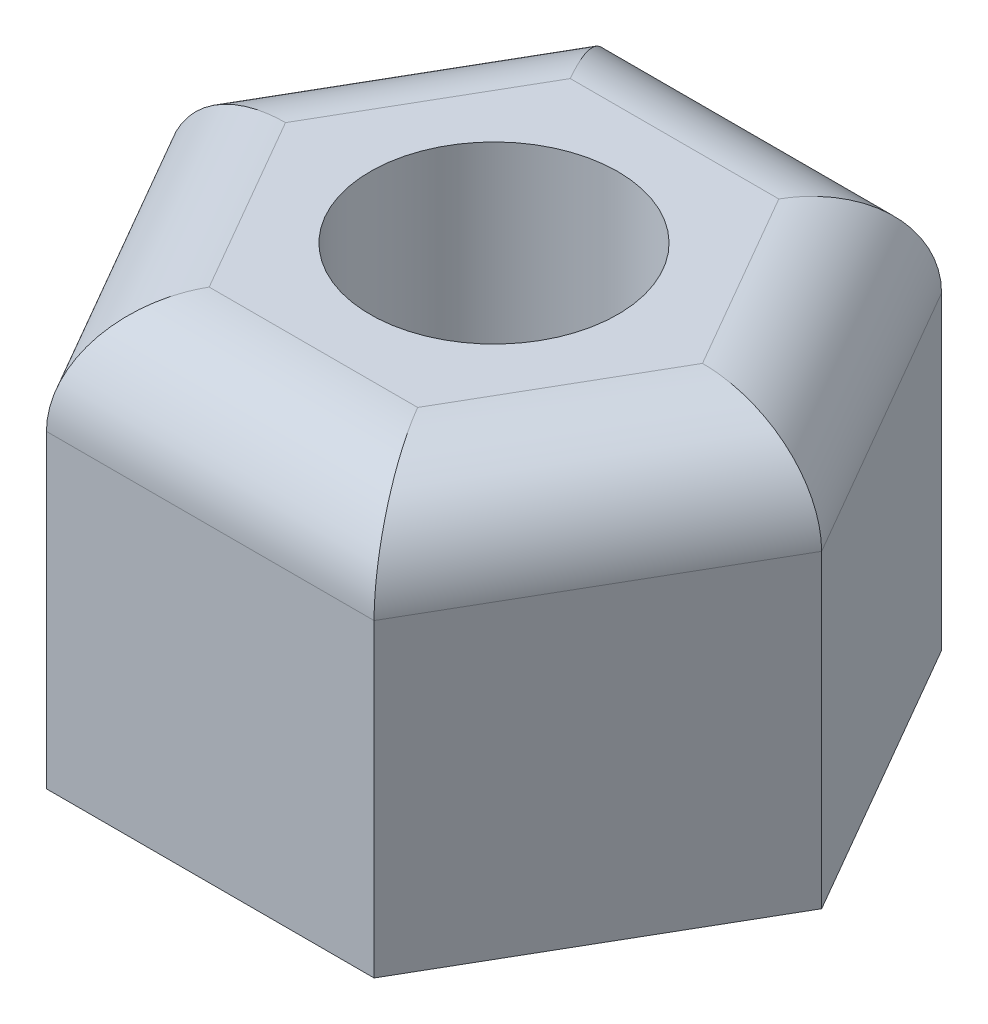
ISO-10303-21;
HEADER;
FILE_DESCRIPTION(('STEP AP214'),'2;1');
FILE_NAME('part.step','',(''),(''),'','','');
FILE_SCHEMA(('AUTOMOTIVE_DESIGN { 1 0 10303 214 1 1 1 1 }'));
ENDSEC;
DATA;
#1=APPLICATION_CONTEXT('core data for automotive mechanical design processes');
#2=APPLICATION_PROTOCOL_DEFINITION('international standard','automotive_design',2000,#1);
#3=PRODUCT_CONTEXT('',#1,'mechanical');
#4=PRODUCT('Part','Part','',(#3));
#5=PRODUCT_RELATED_PRODUCT_CATEGORY('part','',(#4));
#6=PRODUCT_DEFINITION_FORMATION('','',#4);
#7=PRODUCT_DEFINITION_CONTEXT('part definition',#1,'design');
#8=PRODUCT_DEFINITION('design','',#6,#7);
#9=PRODUCT_DEFINITION_SHAPE('','',#8);
#10=(LENGTH_UNIT() NAMED_UNIT(*) SI_UNIT(.MILLI.,.METRE.));
#11=(NAMED_UNIT(*) PLANE_ANGLE_UNIT() SI_UNIT($,.RADIAN.));
#12=(NAMED_UNIT(*) SI_UNIT($,.STERADIAN.) SOLID_ANGLE_UNIT());
#13=UNCERTAINTY_MEASURE_WITH_UNIT(LENGTH_MEASURE(1.E-05),#10,'distance_accuracy_value','');
#14=(GEOMETRIC_REPRESENTATION_CONTEXT(3) GLOBAL_UNCERTAINTY_ASSIGNED_CONTEXT((#13)) GLOBAL_UNIT_ASSIGNED_CONTEXT((#10,
#11,#12)) REPRESENTATION_CONTEXT('',''));
#15=CARTESIAN_POINT('',(0.,0.,0.));
#16=DIRECTION('',(0.,0.,1.));
#17=DIRECTION('',(1.,0.,0.));
#18=AXIS2_PLACEMENT_3D('',#15,#16,#17);
#19=CARTESIAN_POINT('',(1.5877132402715,4.,2.74999999999998));
#20=DIRECTION('',(-0.866025403784442,0.,-0.499999999999995));
#21=DIRECTION('',(-0.499999999999995,0.,0.866025403784442));
#22=AXIS2_PLACEMENT_3D('',#19,#20,#21);
#23=PLANE('',#22);
#24=DIRECTION('',(0.,-1.,0.));
#25=VECTOR('',#24,1.);
#26=CARTESIAN_POINT('',(3.17542648054294,4.,0.));
#27=LINE('',#26,#25);
#28=CARTESIAN_POINT('',(3.17542648054294,3.,0.));
#29=VERTEX_POINT('',#28);
#30=CARTESIAN_POINT('',(3.17542648054294,0.,0.));
#31=VERTEX_POINT('',#30);
#32=EDGE_CURVE('E103',#29,#31,#27,.T.);
#33=ORIENTED_EDGE('',*,*,#32,.F.);
#34=DIRECTION('',(0.499999999999995,0.,-0.866025403784442));
#35=VECTOR('',#34,1.);
#36=CARTESIAN_POINT('',(1.5877132402715,3.,2.74999999999998));
#37=LINE('',#36,#35);
#38=CARTESIAN_POINT('',(1.5877132402715,3.,2.74999999999998));
#39=VERTEX_POINT('',#38);
#40=EDGE_CURVE('E11',#29,#39,#37,.F.);
#41=ORIENTED_EDGE('',*,*,#40,.T.);
#42=DIRECTION('',(0.,-1.,0.));
#43=VECTOR('',#42,1.);
#44=CARTESIAN_POINT('',(1.5877132402715,4.,2.74999999999998));
#45=LINE('',#44,#43);
#46=CARTESIAN_POINT('',(1.5877132402715,0.,2.74999999999998));
#47=VERTEX_POINT('',#46);
#48=EDGE_CURVE('E124',#39,#47,#45,.T.);
#49=ORIENTED_EDGE('',*,*,#48,.T.);
#50=DIRECTION('',(0.499999999999995,0.,-0.866025403784442));
#51=VECTOR('',#50,1.);
#52=CARTESIAN_POINT('',(1.5877132402715,0.,2.74999999999998));
#53=LINE('',#52,#51);
#54=EDGE_CURVE('E118',#47,#31,#53,.T.);
#55=ORIENTED_EDGE('',*,*,#54,.T.);
#56=EDGE_LOOP('',(#33,#41,#49,#55));
#57=FACE_BOUND('',#56,.T.);
#58=ADVANCED_FACE('F33',(#57),#23,.F.);
#59=CARTESIAN_POINT('',(3.17542648054294,4.,0.));
#60=DIRECTION('',(-0.866025403784438,0.,0.500000000000001));
#61=DIRECTION('',(0.500000000000001,0.,0.866025403784438));
#62=AXIS2_PLACEMENT_3D('',#59,#60,#61);
#63=PLANE('',#62);
#64=DIRECTION('',(0.,-1.,0.));
#65=VECTOR('',#64,1.);
#66=CARTESIAN_POINT('',(1.58771324027147,4.,-2.75000000000001));
#67=LINE('',#66,#65);
#68=CARTESIAN_POINT('',(1.58771324027147,3.,-2.75000000000001));
#69=VERTEX_POINT('',#68);
#70=CARTESIAN_POINT('',(1.58771324027147,0.,-2.75000000000001));
#71=VERTEX_POINT('',#70);
#72=EDGE_CURVE('E112',#69,#71,#67,.T.);
#73=ORIENTED_EDGE('',*,*,#72,.F.);
#74=DIRECTION('',(-0.500000000000001,0.,-0.866025403784438));
#75=VECTOR('',#74,1.);
#76=CARTESIAN_POINT('',(3.17542648054294,3.,0.));
#77=LINE('',#76,#75);
#78=EDGE_CURVE('E42',#69,#29,#77,.F.);
#79=ORIENTED_EDGE('',*,*,#78,.T.);
#80=ORIENTED_EDGE('',*,*,#32,.T.);
#81=DIRECTION('',(-0.500000000000001,0.,-0.866025403784438));
#82=VECTOR('',#81,1.);
#83=CARTESIAN_POINT('',(3.17542648054294,0.,0.));
#84=LINE('',#83,#82);
#85=EDGE_CURVE('E106',#31,#71,#84,.T.);
#86=ORIENTED_EDGE('',*,*,#85,.T.);
#87=EDGE_LOOP('',(#73,#79,#80,#86));
#88=FACE_BOUND('',#87,.T.);
#89=ADVANCED_FACE('F105',(#88),#63,.F.);
#90=CARTESIAN_POINT('',(1.58771324027147,4.,-2.75000000000001));
#91=DIRECTION('',(0.,0.,1.));
#92=DIRECTION('',(1.,0.,0.));
#93=AXIS2_PLACEMENT_3D('',#90,#91,#92);
#94=PLANE('',#93);
#95=DIRECTION('',(0.,-1.,0.));
#96=VECTOR('',#95,1.);
#97=CARTESIAN_POINT('',(-1.58771324027148,4.,-2.74999999999999));
#98=LINE('',#97,#96);
#99=CARTESIAN_POINT('',(-1.58771324027148,3.,-2.74999999999999));
#100=VERTEX_POINT('',#99);
#101=CARTESIAN_POINT('',(-1.58771324027148,0.,-2.74999999999999));
#102=VERTEX_POINT('',#101);
#103=EDGE_CURVE('E147',#100,#102,#98,.T.);
#104=ORIENTED_EDGE('',*,*,#103,.F.);
#105=DIRECTION('',(-1.,0.,0.));
#106=VECTOR('',#105,1.);
#107=CARTESIAN_POINT('',(1.58771324027147,3.,-2.75000000000001));
#108=LINE('',#107,#106);
#109=EDGE_CURVE('E57',#100,#69,#108,.F.);
#110=ORIENTED_EDGE('',*,*,#109,.T.);
#111=ORIENTED_EDGE('',*,*,#72,.T.);
#112=DIRECTION('',(-1.,0.,0.));
#113=VECTOR('',#112,1.);
#114=CARTESIAN_POINT('',(1.58771324027147,0.,-2.75000000000001));
#115=LINE('',#114,#113);
#116=EDGE_CURVE('E121',#71,#102,#115,.T.);
#117=ORIENTED_EDGE('',*,*,#116,.T.);
#118=EDGE_LOOP('',(#104,#110,#111,#117));
#119=FACE_BOUND('',#118,.T.);
#120=ADVANCED_FACE('F230',(#119),#94,.F.);
#121=CARTESIAN_POINT('',(-1.58771324027148,4.,-2.74999999999999));
#122=DIRECTION('',(0.866025403784441,0.,0.499999999999995));
#123=DIRECTION('',(0.499999999999995,0.,-0.866025403784442));
#124=AXIS2_PLACEMENT_3D('',#121,#122,#123);
#125=PLANE('',#124);
#126=DIRECTION('',(0.,-1.,0.));
#127=VECTOR('',#126,1.);
#128=CARTESIAN_POINT('',(-3.17542648054294,4.,0.));
#129=LINE('',#128,#127);
#130=CARTESIAN_POINT('',(-3.17542648054294,3.,0.));
#131=VERTEX_POINT('',#130);
#132=CARTESIAN_POINT('',(-3.17542648054294,0.,0.));
#133=VERTEX_POINT('',#132);
#134=EDGE_CURVE('E145',#131,#133,#129,.T.);
#135=ORIENTED_EDGE('',*,*,#134,.F.);
#136=DIRECTION('',(-0.499999999999995,0.,0.866025403784442));
#137=VECTOR('',#136,1.);
#138=CARTESIAN_POINT('',(-1.58771324027148,3.,-2.74999999999999));
#139=LINE('',#138,#137);
#140=EDGE_CURVE('E167',#131,#100,#139,.F.);
#141=ORIENTED_EDGE('',*,*,#140,.T.);
#142=ORIENTED_EDGE('',*,*,#103,.T.);
#143=DIRECTION('',(-0.499999999999995,0.,0.866025403784441));
#144=VECTOR('',#143,1.);
#145=CARTESIAN_POINT('',(-1.58771324027148,0.,-2.74999999999999));
#146=LINE('',#145,#144);
#147=EDGE_CURVE('E134',#102,#133,#146,.T.);
#148=ORIENTED_EDGE('',*,*,#147,.T.);
#149=EDGE_LOOP('',(#135,#141,#142,#148));
#150=FACE_BOUND('',#149,.T.);
#151=ADVANCED_FACE('F215',(#150),#125,.F.);
#152=CARTESIAN_POINT('',(-3.17542648054294,4.,0.));
#153=DIRECTION('',(0.866025403784435,0.,-0.500000000000007));
#154=DIRECTION('',(-0.500000000000007,0.,-0.866025403784435));
#155=AXIS2_PLACEMENT_3D('',#152,#153,#154);
#156=PLANE('',#155);
#157=DIRECTION('',(0.,-1.,0.));
#158=VECTOR('',#157,1.);
#159=CARTESIAN_POINT('',(-1.58771324027145,4.,2.75000000000002));
#160=LINE('',#159,#158);
#161=CARTESIAN_POINT('',(-1.58771324027145,3.,2.75000000000002));
#162=VERTEX_POINT('',#161);
#163=CARTESIAN_POINT('',(-1.58771324027145,0.,2.75000000000002));
#164=VERTEX_POINT('',#163);
#165=EDGE_CURVE('E143',#162,#164,#160,.T.);
#166=ORIENTED_EDGE('',*,*,#165,.F.);
#167=DIRECTION('',(0.500000000000007,0.,0.866025403784435));
#168=VECTOR('',#167,1.);
#169=CARTESIAN_POINT('',(-3.17542648054294,3.,0.));
#170=LINE('',#169,#168);
#171=EDGE_CURVE('E165',#162,#131,#170,.F.);
#172=ORIENTED_EDGE('',*,*,#171,.T.);
#173=ORIENTED_EDGE('',*,*,#134,.T.);
#174=DIRECTION('',(0.500000000000007,0.,0.866025403784435));
#175=VECTOR('',#174,1.);
#176=CARTESIAN_POINT('',(-3.17542648054294,0.,0.));
#177=LINE('',#176,#175);
#178=EDGE_CURVE('E137',#133,#164,#177,.T.);
#179=ORIENTED_EDGE('',*,*,#178,.T.);
#180=EDGE_LOOP('',(#166,#172,#173,#179));
#181=FACE_BOUND('',#180,.T.);
#182=ADVANCED_FACE('F212',(#181),#156,.F.);
#183=CARTESIAN_POINT('',(-1.58771324027145,4.,2.75000000000002));
#184=DIRECTION('',(0.,0.,-1.));
#185=DIRECTION('',(-1.,0.,0.));
#186=AXIS2_PLACEMENT_3D('',#183,#184,#185);
#187=PLANE('',#186);
#188=ORIENTED_EDGE('',*,*,#48,.F.);
#189=DIRECTION('',(1.,0.,0.));
#190=VECTOR('',#189,1.);
#191=CARTESIAN_POINT('',(-1.58771324027145,3.,2.75000000000002));
#192=LINE('',#191,#190);
#193=EDGE_CURVE('E162',#39,#162,#192,.F.);
#194=ORIENTED_EDGE('',*,*,#193,.T.);
#195=ORIENTED_EDGE('',*,*,#165,.T.);
#196=DIRECTION('',(1.,0.,0.));
#197=VECTOR('',#196,1.);
#198=CARTESIAN_POINT('',(-1.58771324027145,0.,2.75000000000002));
#199=LINE('',#198,#197);
#200=EDGE_CURVE('E140',#164,#47,#199,.T.);
#201=ORIENTED_EDGE('',*,*,#200,.T.);
#202=EDGE_LOOP('',(#188,#194,#195,#201));
#203=FACE_BOUND('',#202,.T.);
#204=ADVANCED_FACE('F201',(#203),#187,.F.);
#205=CARTESIAN_POINT('',(0.,4.,0.));
#206=DIRECTION('',(0.,1.,0.));
#207=DIRECTION('',(0.,0.,1.));
#208=AXIS2_PLACEMENT_3D('',#205,#206,#207);
#209=PLANE('',#208);
#210=CARTESIAN_POINT('',(0.,4.,0.));
#211=DIRECTION('',(0.,-1.,0.));
#212=DIRECTION('',(0.,0.,-1.));
#213=AXIS2_PLACEMENT_3D('',#210,#211,#212);
#214=CIRCLE('',#213,1.2);
#215=CARTESIAN_POINT('',(0.,4.,-1.2));
#216=VERTEX_POINT('',#215);
#217=EDGE_CURVE('E174',#216,#216,#214,.T.);
#218=ORIENTED_EDGE('',*,*,#217,.T.);
#219=EDGE_LOOP('',(#218));
#220=FACE_BOUND('',#219,.T.);
#221=DIRECTION('',(0.500000000000007,0.,0.866025403784435));
#222=VECTOR('',#221,1.);
#223=CARTESIAN_POINT('',(-0.721687836487011,4.,2.25000000000001));
#224=LINE('',#223,#222);
#225=CARTESIAN_POINT('',(-2.02072594216369,4.,0.));
#226=VERTEX_POINT('',#225);
#227=CARTESIAN_POINT('',(-1.01036297108183,4.,1.75000000000001));
#228=VERTEX_POINT('',#227);
#229=EDGE_CURVE('E157',#226,#228,#224,.T.);
#230=ORIENTED_EDGE('',*,*,#229,.T.);
#231=DIRECTION('',(1.,0.,0.));
#232=VECTOR('',#231,1.);
#233=CARTESIAN_POINT('',(1.58771324027149,4.,1.74999999999998));
#234=LINE('',#233,#232);
#235=CARTESIAN_POINT('',(1.01036297108187,4.,1.74999999999999));
#236=VERTEX_POINT('',#235);
#237=EDGE_CURVE('E159',#228,#236,#234,.T.);
#238=ORIENTED_EDGE('',*,*,#237,.T.);
#239=DIRECTION('',(0.499999999999995,0.,-0.866025403784442));
#240=VECTOR('',#239,1.);
#241=CARTESIAN_POINT('',(2.3094010767585,4.,-0.499999999999995));
#242=LINE('',#241,#240);
#243=CARTESIAN_POINT('',(2.02072594216369,4.,0.));
#244=VERTEX_POINT('',#243);
#245=EDGE_CURVE('E111',#236,#244,#242,.T.);
#246=ORIENTED_EDGE('',*,*,#245,.T.);
#247=DIRECTION('',(-0.500000000000001,0.,-0.866025403784438));
#248=VECTOR('',#247,1.);
#249=CARTESIAN_POINT('',(0.721687836487028,4.,-2.25));
#250=LINE('',#249,#248);
#251=CARTESIAN_POINT('',(1.01036297108184,4.,-1.75));
#252=VERTEX_POINT('',#251);
#253=EDGE_CURVE('E151',#244,#252,#250,.T.);
#254=ORIENTED_EDGE('',*,*,#253,.T.);
#255=DIRECTION('',(-1.,0.,0.));
#256=VECTOR('',#255,1.);
#257=CARTESIAN_POINT('',(-1.58771324027148,4.,-1.74999999999999));
#258=LINE('',#257,#256);
#259=CARTESIAN_POINT('',(-1.01036297108185,4.,-1.75));
#260=VERTEX_POINT('',#259);
#261=EDGE_CURVE('E153',#252,#260,#258,.T.);
#262=ORIENTED_EDGE('',*,*,#261,.T.);
#263=DIRECTION('',(-0.499999999999995,0.,0.866025403784442));
#264=VECTOR('',#263,1.);
#265=CARTESIAN_POINT('',(-2.3094010767585,4.,0.500000000000018));
#266=LINE('',#265,#264);
#267=EDGE_CURVE('E155',#260,#226,#266,.T.);
#268=ORIENTED_EDGE('',*,*,#267,.T.);
#269=EDGE_LOOP('',(#230,#238,#246,#254,#262,#268));
#270=FACE_BOUND('',#269,.T.);
#271=ADVANCED_FACE('F191',(#220,#270),#209,.T.);
#272=CARTESIAN_POINT('',(0.,0.,0.));
#273=DIRECTION('',(0.,1.,0.));
#274=DIRECTION('',(0.,0.,1.));
#275=AXIS2_PLACEMENT_3D('',#272,#273,#274);
#276=PLANE('',#275);
#277=CARTESIAN_POINT('',(0.,0.,0.));
#278=DIRECTION('',(0.,-1.,0.));
#279=DIRECTION('',(0.,0.,-1.));
#280=AXIS2_PLACEMENT_3D('',#277,#278,#279);
#281=CIRCLE('',#280,1.2);
#282=CARTESIAN_POINT('',(0.,0.,-1.2));
#283=VERTEX_POINT('',#282);
#284=EDGE_CURVE('E130',#283,#283,#281,.T.);
#285=ORIENTED_EDGE('',*,*,#284,.F.);
#286=EDGE_LOOP('',(#285));
#287=FACE_BOUND('',#286,.T.);
#288=ORIENTED_EDGE('',*,*,#54,.F.);
#289=ORIENTED_EDGE('',*,*,#200,.F.);
#290=ORIENTED_EDGE('',*,*,#178,.F.);
#291=ORIENTED_EDGE('',*,*,#147,.F.);
#292=ORIENTED_EDGE('',*,*,#116,.F.);
#293=ORIENTED_EDGE('',*,*,#85,.F.);
#294=EDGE_LOOP('',(#288,#289,#290,#291,#292,#293));
#295=FACE_BOUND('',#294,.T.);
#296=ADVANCED_FACE('F116',(#287,#295),#276,.F.);
#297=CARTESIAN_POINT('',(0.,3.,-1.75));
#298=DIRECTION('',(1.,0.,0.));
#299=DIRECTION('',(0.,0.,-1.));
#300=AXIS2_PLACEMENT_3D('',#297,#298,#299);
#301=CYLINDRICAL_SURFACE('',#300,1.);
#302=CARTESIAN_POINT('',(1.01036297108184,3.,-1.75));
#303=DIRECTION('',(0.86602540378444,0.,0.499999999999998));
#304=DIRECTION('',(-0.499999999999998,0.,0.86602540378444));
#305=AXIS2_PLACEMENT_3D('',#302,#303,#304);
#306=ELLIPSE('',#305,1.15470053837925,1.);
#307=EDGE_CURVE('E128',#69,#252,#306,.T.);
#308=ORIENTED_EDGE('',*,*,#307,.F.);
#309=ORIENTED_EDGE('',*,*,#109,.F.);
#310=CARTESIAN_POINT('',(-1.01036297108185,3.,-1.75));
#311=DIRECTION('',(0.866025403784436,0.,-0.500000000000004));
#312=DIRECTION('',(0.500000000000004,0.,0.866025403784436));
#313=AXIS2_PLACEMENT_3D('',#310,#311,#312);
#314=ELLIPSE('',#313,1.15470053837925,1.);
#315=EDGE_CURVE('E37',#260,#100,#314,.F.);
#316=ORIENTED_EDGE('',*,*,#315,.F.);
#317=ORIENTED_EDGE('',*,*,#261,.F.);
#318=EDGE_LOOP('',(#308,#309,#316,#317));
#319=FACE_BOUND('',#318,.T.);
#320=ADVANCED_FACE('F35',(#319),#301,.T.);
#321=CARTESIAN_POINT('',(-1.51554445662277,3.,-0.874999999999991));
#322=DIRECTION('',(0.499999999999995,0.,-0.866025403784442));
#323=DIRECTION('',(-0.866025403784441,0.,-0.499999999999995));
#324=AXIS2_PLACEMENT_3D('',#321,#322,#323);
#325=CYLINDRICAL_SURFACE('',#324,1.);
#326=ORIENTED_EDGE('',*,*,#315,.T.);
#327=ORIENTED_EDGE('',*,*,#140,.F.);
#328=CARTESIAN_POINT('',(-2.02072594216369,3.,0.));
#329=DIRECTION('',(0.,0.,-1.));
#330=DIRECTION('',(1.,0.,0.));
#331=AXIS2_PLACEMENT_3D('',#328,#329,#330);
#332=ELLIPSE('',#331,1.15470053837925,1.);
#333=EDGE_CURVE('E179',#226,#131,#332,.F.);
#334=ORIENTED_EDGE('',*,*,#333,.F.);
#335=ORIENTED_EDGE('',*,*,#267,.F.);
#336=EDGE_LOOP('',(#326,#327,#334,#335));
#337=FACE_BOUND('',#336,.T.);
#338=ADVANCED_FACE('F218',(#337),#325,.T.);
#339=CARTESIAN_POINT('',(1.51554445662277,3.,-0.875000000000002));
#340=DIRECTION('',(0.500000000000001,0.,0.866025403784438));
#341=DIRECTION('',(0.866025403784438,0.,-0.500000000000001));
#342=AXIS2_PLACEMENT_3D('',#339,#340,#341);
#343=CYLINDRICAL_SURFACE('',#342,1.);
#344=ORIENTED_EDGE('',*,*,#307,.T.);
#345=ORIENTED_EDGE('',*,*,#253,.F.);
#346=CARTESIAN_POINT('',(2.02072594216369,3.,0.));
#347=DIRECTION('',(0.,0.,1.));
#348=DIRECTION('',(-1.,0.,0.));
#349=AXIS2_PLACEMENT_3D('',#346,#347,#348);
#350=ELLIPSE('',#349,1.15470053837925,1.);
#351=EDGE_CURVE('E176',#29,#244,#350,.T.);
#352=ORIENTED_EDGE('',*,*,#351,.F.);
#353=ORIENTED_EDGE('',*,*,#78,.F.);
#354=EDGE_LOOP('',(#344,#345,#352,#353));
#355=FACE_BOUND('',#354,.T.);
#356=ADVANCED_FACE('F185',(#355),#343,.T.);
#357=CARTESIAN_POINT('',(-1.51554445662276,3.,0.875000000000012));
#358=DIRECTION('',(-0.500000000000007,0.,-0.866025403784435));
#359=DIRECTION('',(-0.866025403784435,0.,0.500000000000007));
#360=AXIS2_PLACEMENT_3D('',#357,#358,#359);
#361=CYLINDRICAL_SURFACE('',#360,1.);
#362=ORIENTED_EDGE('',*,*,#333,.T.);
#363=ORIENTED_EDGE('',*,*,#171,.F.);
#364=CARTESIAN_POINT('',(-1.01036297108183,3.,1.75000000000001));
#365=DIRECTION('',(-0.866025403784443,0.,-0.499999999999992));
#366=DIRECTION('',(0.499999999999992,0.,-0.866025403784443));
#367=AXIS2_PLACEMENT_3D('',#364,#365,#366);
#368=ELLIPSE('',#367,1.15470053837925,1.);
#369=EDGE_CURVE('E173',#228,#162,#368,.F.);
#370=ORIENTED_EDGE('',*,*,#369,.F.);
#371=ORIENTED_EDGE('',*,*,#229,.F.);
#372=EDGE_LOOP('',(#362,#363,#370,#371));
#373=FACE_BOUND('',#372,.T.);
#374=ADVANCED_FACE('F209',(#373),#361,.T.);
#375=CARTESIAN_POINT('',(1.51554445662278,3.,0.874999999999997));
#376=DIRECTION('',(-0.499999999999995,0.,0.866025403784442));
#377=DIRECTION('',(0.866025403784442,0.,0.499999999999995));
#378=AXIS2_PLACEMENT_3D('',#375,#376,#377);
#379=CYLINDRICAL_SURFACE('',#378,1.);
#380=ORIENTED_EDGE('',*,*,#351,.T.);
#381=ORIENTED_EDGE('',*,*,#245,.F.);
#382=CARTESIAN_POINT('',(1.01036297108187,3.,1.74999999999999));
#383=DIRECTION('',(-0.866025403784435,0.,0.500000000000007));
#384=DIRECTION('',(0.500000000000007,0.,0.866025403784435));
#385=AXIS2_PLACEMENT_3D('',#382,#383,#384);
#386=ELLIPSE('',#385,1.15470053837925,1.);
#387=EDGE_CURVE('E171',#39,#236,#386,.T.);
#388=ORIENTED_EDGE('',*,*,#387,.F.);
#389=ORIENTED_EDGE('',*,*,#40,.F.);
#390=EDGE_LOOP('',(#380,#381,#388,#389));
#391=FACE_BOUND('',#390,.T.);
#392=ADVANCED_FACE('F197',(#391),#379,.T.);
#393=CARTESIAN_POINT('',(0.,3.,1.75));
#394=DIRECTION('',(-1.,0.,0.));
#395=DIRECTION('',(0.,0.,1.));
#396=AXIS2_PLACEMENT_3D('',#393,#394,#395);
#397=CYLINDRICAL_SURFACE('',#396,1.);
#398=ORIENTED_EDGE('',*,*,#369,.T.);
#399=ORIENTED_EDGE('',*,*,#193,.F.);
#400=ORIENTED_EDGE('',*,*,#387,.T.);
#401=ORIENTED_EDGE('',*,*,#237,.F.);
#402=EDGE_LOOP('',(#398,#399,#400,#401));
#403=FACE_BOUND('',#402,.T.);
#404=ADVANCED_FACE('F204',(#403),#397,.T.);
#405=CARTESIAN_POINT('',(0.,4.,0.));
#406=DIRECTION('',(0.,-1.,0.));
#407=DIRECTION('',(0.,0.,-1.));
#408=AXIS2_PLACEMENT_3D('',#405,#406,#407);
#409=CYLINDRICAL_SURFACE('',#408,1.2);
#410=ORIENTED_EDGE('',*,*,#217,.F.);
#411=EDGE_LOOP('',(#410));
#412=FACE_BOUND('',#411,.T.);
#413=ORIENTED_EDGE('',*,*,#284,.T.);
#414=EDGE_LOOP('',(#413));
#415=FACE_BOUND('',#414,.T.);
#416=ADVANCED_FACE('F236',(#412,#415),#409,.F.);
#417=CLOSED_SHELL('',(#58,#89,#120,#151,#182,#204,#271,#296,#320,#338,#356,#374,#392,#404,#416));
#418=MANIFOLD_SOLID_BREP('B2',#417);
#419=ADVANCED_BREP_SHAPE_REPRESENTATION('',(#18,#418),#14);
#420=SHAPE_DEFINITION_REPRESENTATION(#9,#419);
ENDSEC;
END-ISO-10303-21;
